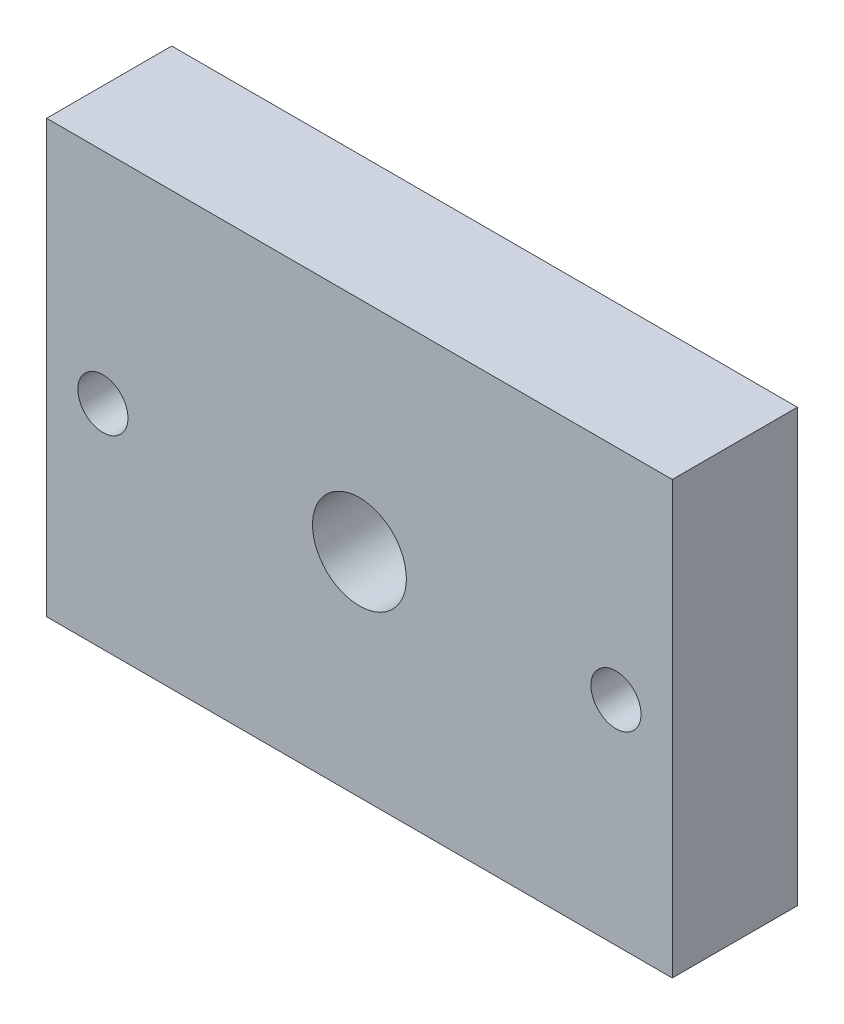
ISO-10303-21;
HEADER;
FILE_DESCRIPTION(('STEP AP214'),'2;1');
FILE_NAME('part.step','',(''),(''),'','','');
FILE_SCHEMA(('AUTOMOTIVE_DESIGN { 1 0 10303 214 1 1 1 1 }'));
ENDSEC;
DATA;
#1=APPLICATION_CONTEXT('core data for automotive mechanical design processes');
#2=APPLICATION_PROTOCOL_DEFINITION('international standard','automotive_design',2000,#1);
#3=PRODUCT_CONTEXT('',#1,'mechanical');
#4=PRODUCT('Part','Part','',(#3));
#5=PRODUCT_RELATED_PRODUCT_CATEGORY('part','',(#4));
#6=PRODUCT_DEFINITION_FORMATION('','',#4);
#7=PRODUCT_DEFINITION_CONTEXT('part definition',#1,'design');
#8=PRODUCT_DEFINITION('design','',#6,#7);
#9=PRODUCT_DEFINITION_SHAPE('','',#8);
#10=(LENGTH_UNIT() NAMED_UNIT(*) SI_UNIT(.MILLI.,.METRE.));
#11=(NAMED_UNIT(*) PLANE_ANGLE_UNIT() SI_UNIT($,.RADIAN.));
#12=(NAMED_UNIT(*) SI_UNIT($,.STERADIAN.) SOLID_ANGLE_UNIT());
#13=UNCERTAINTY_MEASURE_WITH_UNIT(LENGTH_MEASURE(1.E-05),#10,'distance_accuracy_value','');
#14=(GEOMETRIC_REPRESENTATION_CONTEXT(3) GLOBAL_UNCERTAINTY_ASSIGNED_CONTEXT((#13)) GLOBAL_UNIT_ASSIGNED_CONTEXT((#10,
#11,#12)) REPRESENTATION_CONTEXT('',''));
#15=CARTESIAN_POINT('',(0.,0.,0.));
#16=DIRECTION('',(0.,0.,1.));
#17=DIRECTION('',(1.,0.,0.));
#18=AXIS2_PLACEMENT_3D('',#15,#16,#17);
#19=CARTESIAN_POINT('',(50.,-35.,20.));
#20=DIRECTION('',(-1.,0.,0.));
#21=DIRECTION('',(0.,0.,1.));
#22=AXIS2_PLACEMENT_3D('',#19,#20,#21);
#23=PLANE('',#22);
#24=DIRECTION('',(0.,0.,-1.));
#25=VECTOR('',#24,1.);
#26=CARTESIAN_POINT('',(50.,-34.,20.));
#27=LINE('',#26,#25);
#28=CARTESIAN_POINT('',(50.,-34.,20.));
#29=VERTEX_POINT('',#28);
#30=CARTESIAN_POINT('',(50.,-34.,0.));
#31=VERTEX_POINT('',#30);
#32=EDGE_CURVE('E138',#29,#31,#27,.T.);
#33=ORIENTED_EDGE('',*,*,#32,.T.);
#34=DIRECTION('',(0.,1.,0.));
#35=VECTOR('',#34,1.);
#36=CARTESIAN_POINT('',(50.,-35.,0.));
#37=LINE('',#36,#35);
#38=CARTESIAN_POINT('',(50.,35.,0.));
#39=VERTEX_POINT('',#38);
#40=EDGE_CURVE('E88',#31,#39,#37,.T.);
#41=ORIENTED_EDGE('',*,*,#40,.T.);
#42=DIRECTION('',(0.,0.,-1.));
#43=VECTOR('',#42,1.);
#44=CARTESIAN_POINT('',(50.,35.,20.));
#45=LINE('',#44,#43);
#46=CARTESIAN_POINT('',(50.,35.,20.));
#47=VERTEX_POINT('',#46);
#48=EDGE_CURVE('E49',#47,#39,#45,.T.);
#49=ORIENTED_EDGE('',*,*,#48,.F.);
#50=DIRECTION('',(0.,1.,0.));
#51=VECTOR('',#50,1.);
#52=CARTESIAN_POINT('',(50.,-35.,20.));
#53=LINE('',#52,#51);
#54=EDGE_CURVE('E98',#29,#47,#53,.T.);
#55=ORIENTED_EDGE('',*,*,#54,.F.);
#56=EDGE_LOOP('',(#33,#41,#49,#55));
#57=FACE_BOUND('',#56,.T.);
#58=ADVANCED_FACE('F41',(#57),#23,.F.);
#59=CARTESIAN_POINT('',(-50.,-35.,20.));
#60=DIRECTION('',(1.,0.,0.));
#61=DIRECTION('',(0.,0.,-1.));
#62=AXIS2_PLACEMENT_3D('',#59,#60,#61);
#63=PLANE('',#62);
#64=DIRECTION('',(0.,0.,-1.));
#65=VECTOR('',#64,1.);
#66=CARTESIAN_POINT('',(-50.,-34.,20.));
#67=LINE('',#66,#65);
#68=CARTESIAN_POINT('',(-50.,-34.,20.));
#69=VERTEX_POINT('',#68);
#70=CARTESIAN_POINT('',(-50.,-34.,0.));
#71=VERTEX_POINT('',#70);
#72=EDGE_CURVE('E56',#69,#71,#67,.T.);
#73=ORIENTED_EDGE('',*,*,#72,.F.);
#74=DIRECTION('',(0.,-1.,0.));
#75=VECTOR('',#74,1.);
#76=CARTESIAN_POINT('',(-50.,-35.,20.));
#77=LINE('',#76,#75);
#78=CARTESIAN_POINT('',(-50.,35.,20.));
#79=VERTEX_POINT('',#78);
#80=EDGE_CURVE('E93',#79,#69,#77,.T.);
#81=ORIENTED_EDGE('',*,*,#80,.F.);
#82=DIRECTION('',(0.,0.,-1.));
#83=VECTOR('',#82,1.);
#84=CARTESIAN_POINT('',(-50.,35.,20.));
#85=LINE('',#84,#83);
#86=CARTESIAN_POINT('',(-50.,35.,0.));
#87=VERTEX_POINT('',#86);
#88=EDGE_CURVE('E80',#79,#87,#85,.T.);
#89=ORIENTED_EDGE('',*,*,#88,.T.);
#90=DIRECTION('',(0.,-1.,0.));
#91=VECTOR('',#90,1.);
#92=CARTESIAN_POINT('',(-50.,-35.,0.));
#93=LINE('',#92,#91);
#94=EDGE_CURVE('E87',#87,#71,#93,.T.);
#95=ORIENTED_EDGE('',*,*,#94,.T.);
#96=EDGE_LOOP('',(#73,#81,#89,#95));
#97=FACE_BOUND('',#96,.T.);
#98=ADVANCED_FACE('F92',(#97),#63,.F.);
#99=CARTESIAN_POINT('',(0.,0.,20.));
#100=DIRECTION('',(0.,0.,-1.));
#101=DIRECTION('',(-1.,0.,0.));
#102=AXIS2_PLACEMENT_3D('',#99,#100,#101);
#103=PLANE('',#102);
#104=CARTESIAN_POINT('',(41.,0.,20.));
#105=DIRECTION('',(0.,0.,1.));
#106=DIRECTION('',(1.,0.,0.));
#107=AXIS2_PLACEMENT_3D('',#104,#105,#106);
#108=CIRCLE('',#107,4.);
#109=CARTESIAN_POINT('',(45.,0.,20.));
#110=VERTEX_POINT('',#109);
#111=EDGE_CURVE('E126',#110,#110,#108,.T.);
#112=ORIENTED_EDGE('',*,*,#111,.F.);
#113=EDGE_LOOP('',(#112));
#114=FACE_BOUND('',#113,.T.);
#115=CARTESIAN_POINT('',(-41.,0.,20.));
#116=DIRECTION('',(0.,0.,1.));
#117=DIRECTION('',(1.,0.,0.));
#118=AXIS2_PLACEMENT_3D('',#115,#116,#117);
#119=CIRCLE('',#118,4.00000000000001);
#120=CARTESIAN_POINT('',(-37.,0.,20.));
#121=VERTEX_POINT('',#120);
#122=EDGE_CURVE('E111',#121,#121,#119,.T.);
#123=ORIENTED_EDGE('',*,*,#122,.F.);
#124=EDGE_LOOP('',(#123));
#125=FACE_BOUND('',#124,.T.);
#126=CARTESIAN_POINT('',(0.,0.,20.));
#127=DIRECTION('',(0.,0.,1.));
#128=DIRECTION('',(1.,0.,0.));
#129=AXIS2_PLACEMENT_3D('',#126,#127,#128);
#130=CIRCLE('',#129,7.5);
#131=CARTESIAN_POINT('',(7.5,0.,20.));
#132=VERTEX_POINT('',#131);
#133=EDGE_CURVE('E134',#132,#132,#130,.T.);
#134=ORIENTED_EDGE('',*,*,#133,.F.);
#135=EDGE_LOOP('',(#134));
#136=FACE_BOUND('',#135,.T.);
#137=DIRECTION('',(-1.,0.,0.));
#138=VECTOR('',#137,1.);
#139=CARTESIAN_POINT('',(-50.,-34.,20.));
#140=LINE('',#139,#138);
#141=EDGE_CURVE('E146',#29,#69,#140,.T.);
#142=ORIENTED_EDGE('',*,*,#141,.F.);
#143=ORIENTED_EDGE('',*,*,#54,.T.);
#144=DIRECTION('',(-1.,0.,0.));
#145=VECTOR('',#144,1.);
#146=CARTESIAN_POINT('',(-50.,35.,20.));
#147=LINE('',#146,#145);
#148=EDGE_CURVE('E64',#47,#79,#147,.T.);
#149=ORIENTED_EDGE('',*,*,#148,.T.);
#150=ORIENTED_EDGE('',*,*,#80,.T.);
#151=EDGE_LOOP('',(#142,#143,#149,#150));
#152=FACE_BOUND('',#151,.T.);
#153=ADVANCED_FACE('F156',(#114,#125,#136,#152),#103,.F.);
#154=CARTESIAN_POINT('',(0.,0.,0.));
#155=DIRECTION('',(0.,0.,-1.));
#156=DIRECTION('',(-1.,0.,0.));
#157=AXIS2_PLACEMENT_3D('',#154,#155,#156);
#158=PLANE('',#157);
#159=CARTESIAN_POINT('',(-41.,0.,0.));
#160=DIRECTION('',(0.,0.,-1.));
#161=DIRECTION('',(-1.,0.,0.));
#162=AXIS2_PLACEMENT_3D('',#159,#160,#161);
#163=CIRCLE('',#162,4.00000000000001);
#164=CARTESIAN_POINT('',(-45.,0.,0.));
#165=VERTEX_POINT('',#164);
#166=EDGE_CURVE('E110',#165,#165,#163,.F.);
#167=ORIENTED_EDGE('',*,*,#166,.T.);
#168=EDGE_LOOP('',(#167));
#169=FACE_BOUND('',#168,.T.);
#170=CARTESIAN_POINT('',(41.,0.,0.));
#171=DIRECTION('',(0.,0.,-1.));
#172=DIRECTION('',(-1.,0.,0.));
#173=AXIS2_PLACEMENT_3D('',#170,#171,#172);
#174=CIRCLE('',#173,4.);
#175=CARTESIAN_POINT('',(37.,0.,0.));
#176=VERTEX_POINT('',#175);
#177=EDGE_CURVE('E107',#176,#176,#174,.F.);
#178=ORIENTED_EDGE('',*,*,#177,.T.);
#179=EDGE_LOOP('',(#178));
#180=FACE_BOUND('',#179,.T.);
#181=ORIENTED_EDGE('',*,*,#40,.F.);
#182=DIRECTION('',(-1.,0.,0.));
#183=VECTOR('',#182,1.);
#184=CARTESIAN_POINT('',(0.,-34.,0.));
#185=LINE('',#184,#183);
#186=EDGE_CURVE('E11',#31,#71,#185,.T.);
#187=ORIENTED_EDGE('',*,*,#186,.T.);
#188=ORIENTED_EDGE('',*,*,#94,.F.);
#189=DIRECTION('',(-1.,0.,0.));
#190=VECTOR('',#189,1.);
#191=CARTESIAN_POINT('',(-50.,35.,0.));
#192=LINE('',#191,#190);
#193=EDGE_CURVE('E77',#39,#87,#192,.T.);
#194=ORIENTED_EDGE('',*,*,#193,.F.);
#195=EDGE_LOOP('',(#181,#187,#188,#194));
#196=FACE_BOUND('',#195,.T.);
#197=ADVANCED_FACE('F96',(#169,#180,#196),#158,.T.);
#198=CARTESIAN_POINT('',(-50.,35.,20.));
#199=DIRECTION('',(0.,-1.,0.));
#200=DIRECTION('',(0.,0.,-1.));
#201=AXIS2_PLACEMENT_3D('',#198,#199,#200);
#202=PLANE('',#201);
#203=ORIENTED_EDGE('',*,*,#193,.T.);
#204=ORIENTED_EDGE('',*,*,#88,.F.);
#205=ORIENTED_EDGE('',*,*,#148,.F.);
#206=ORIENTED_EDGE('',*,*,#48,.T.);
#207=EDGE_LOOP('',(#203,#204,#205,#206));
#208=FACE_BOUND('',#207,.T.);
#209=ADVANCED_FACE('F79',(#208),#202,.F.);
#210=CARTESIAN_POINT('',(41.,0.,20.));
#211=DIRECTION('',(0.,0.,-1.));
#212=DIRECTION('',(-1.,0.,0.));
#213=AXIS2_PLACEMENT_3D('',#210,#211,#212);
#214=CYLINDRICAL_SURFACE('',#213,4.);
#215=ORIENTED_EDGE('',*,*,#177,.F.);
#216=EDGE_LOOP('',(#215));
#217=FACE_BOUND('',#216,.T.);
#218=ORIENTED_EDGE('',*,*,#111,.T.);
#219=EDGE_LOOP('',(#218));
#220=FACE_BOUND('',#219,.T.);
#221=ADVANCED_FACE('F197',(#217,#220),#214,.F.);
#222=CARTESIAN_POINT('',(-41.,0.,20.));
#223=DIRECTION('',(0.,0.,-1.));
#224=DIRECTION('',(-1.,0.,0.));
#225=AXIS2_PLACEMENT_3D('',#222,#223,#224);
#226=CYLINDRICAL_SURFACE('',#225,4.00000000000001);
#227=ORIENTED_EDGE('',*,*,#166,.F.);
#228=EDGE_LOOP('',(#227));
#229=FACE_BOUND('',#228,.T.);
#230=ORIENTED_EDGE('',*,*,#122,.T.);
#231=EDGE_LOOP('',(#230));
#232=FACE_BOUND('',#231,.T.);
#233=ADVANCED_FACE('F205',(#229,#232),#226,.F.);
#234=CARTESIAN_POINT('',(0.,0.,5.));
#235=DIRECTION('',(0.,0.,1.));
#236=DIRECTION('',(1.,0.,0.));
#237=AXIS2_PLACEMENT_3D('',#234,#235,#236);
#238=CYLINDRICAL_SURFACE('',#237,7.5);
#239=CARTESIAN_POINT('',(0.,0.,5.));
#240=DIRECTION('',(0.,0.,1.));
#241=DIRECTION('',(1.,0.,0.));
#242=AXIS2_PLACEMENT_3D('',#239,#240,#241);
#243=CIRCLE('',#242,7.5);
#244=CARTESIAN_POINT('',(7.5,0.,5.));
#245=VERTEX_POINT('',#244);
#246=EDGE_CURVE('E130',#245,#245,#243,.T.);
#247=ORIENTED_EDGE('',*,*,#246,.F.);
#248=EDGE_LOOP('',(#247));
#249=FACE_BOUND('',#248,.T.);
#250=ORIENTED_EDGE('',*,*,#133,.T.);
#251=EDGE_LOOP('',(#250));
#252=FACE_BOUND('',#251,.T.);
#253=ADVANCED_FACE('F214',(#249,#252),#238,.F.);
#254=CARTESIAN_POINT('',(0.,0.,5.));
#255=DIRECTION('',(0.,0.,1.));
#256=DIRECTION('',(1.,0.,0.));
#257=AXIS2_PLACEMENT_3D('',#254,#255,#256);
#258=PLANE('',#257);
#259=ORIENTED_EDGE('',*,*,#246,.T.);
#260=EDGE_LOOP('',(#259));
#261=FACE_BOUND('',#260,.T.);
#262=ADVANCED_FACE('F224',(#261),#258,.T.);
#263=CARTESIAN_POINT('',(-50.,-34.,20.));
#264=DIRECTION('',(0.,-1.,0.));
#265=DIRECTION('',(0.,0.,-1.));
#266=AXIS2_PLACEMENT_3D('',#263,#264,#265);
#267=PLANE('',#266);
#268=ORIENTED_EDGE('',*,*,#32,.F.);
#269=ORIENTED_EDGE('',*,*,#141,.T.);
#270=ORIENTED_EDGE('',*,*,#72,.T.);
#271=ORIENTED_EDGE('',*,*,#186,.F.);
#272=EDGE_LOOP('',(#268,#269,#270,#271));
#273=FACE_BOUND('',#272,.T.);
#274=ADVANCED_FACE('F152',(#273),#267,.T.);
#275=CLOSED_SHELL('',(#58,#98,#153,#197,#209,#221,#233,#253,#262,#274));
#276=MANIFOLD_SOLID_BREP('B2',#275);
#277=ADVANCED_BREP_SHAPE_REPRESENTATION('',(#18,#276),#14);
#278=SHAPE_DEFINITION_REPRESENTATION(#9,#277);
ENDSEC;
END-ISO-10303-21;
